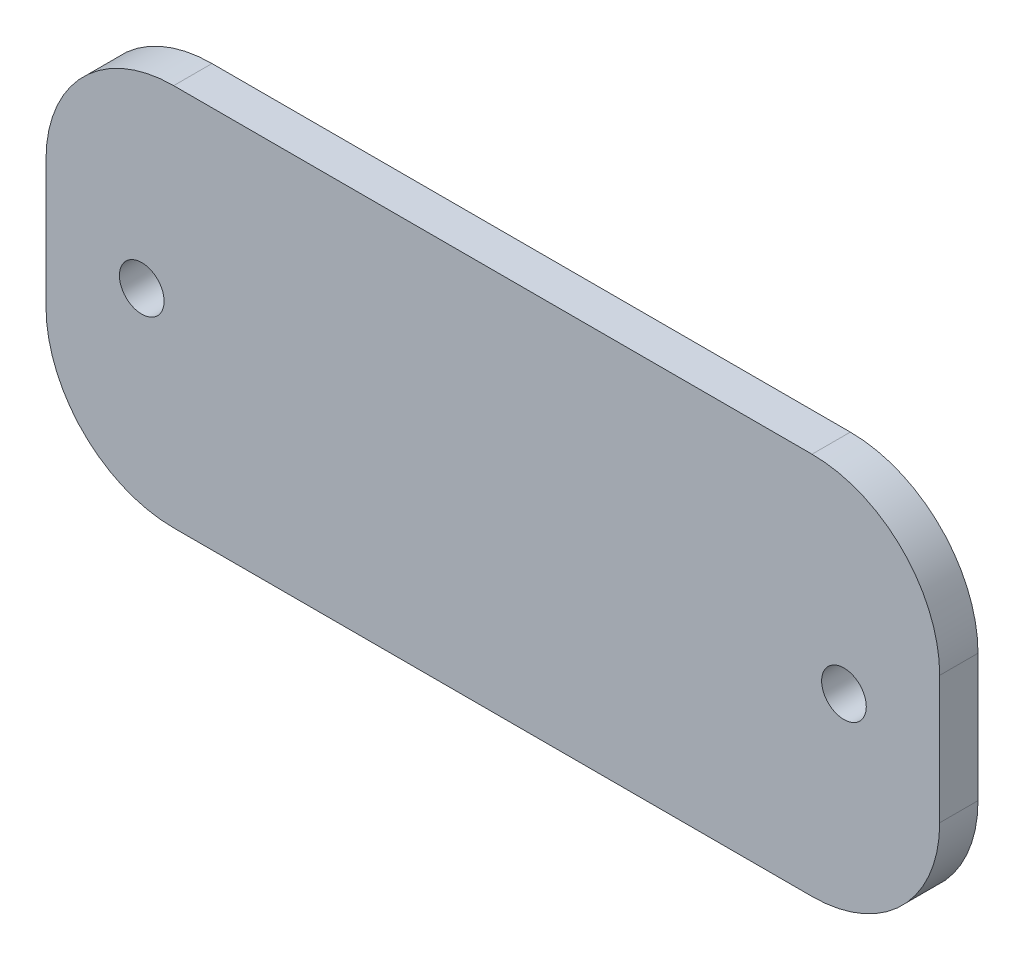
ISO-10303-21;
HEADER;
FILE_DESCRIPTION(('STEP AP214'),'2;1');
FILE_NAME('part.step','',(''),(''),'','','');
FILE_SCHEMA(('AUTOMOTIVE_DESIGN { 1 0 10303 214 1 1 1 1 }'));
ENDSEC;
DATA;
#1=APPLICATION_CONTEXT('core data for automotive mechanical design processes');
#2=APPLICATION_PROTOCOL_DEFINITION('international standard','automotive_design',2000,#1);
#3=PRODUCT_CONTEXT('',#1,'mechanical');
#4=PRODUCT('Part','Part','',(#3));
#5=PRODUCT_RELATED_PRODUCT_CATEGORY('part','',(#4));
#6=PRODUCT_DEFINITION_FORMATION('','',#4);
#7=PRODUCT_DEFINITION_CONTEXT('part definition',#1,'design');
#8=PRODUCT_DEFINITION('design','',#6,#7);
#9=PRODUCT_DEFINITION_SHAPE('','',#8);
#10=(LENGTH_UNIT() NAMED_UNIT(*) SI_UNIT(.MILLI.,.METRE.));
#11=(NAMED_UNIT(*) PLANE_ANGLE_UNIT() SI_UNIT($,.RADIAN.));
#12=(NAMED_UNIT(*) SI_UNIT($,.STERADIAN.) SOLID_ANGLE_UNIT());
#13=UNCERTAINTY_MEASURE_WITH_UNIT(LENGTH_MEASURE(1.E-05),#10,'distance_accuracy_value','');
#14=(GEOMETRIC_REPRESENTATION_CONTEXT(3) GLOBAL_UNCERTAINTY_ASSIGNED_CONTEXT((#13)) GLOBAL_UNIT_ASSIGNED_CONTEXT((#10,
#11,#12)) REPRESENTATION_CONTEXT('',''));
#15=CARTESIAN_POINT('',(0.,0.,0.));
#16=DIRECTION('',(0.,0.,1.));
#17=DIRECTION('',(1.,0.,0.));
#18=AXIS2_PLACEMENT_3D('',#15,#16,#17);
#19=CARTESIAN_POINT('',(25.,5.,3.));
#20=DIRECTION('',(0.,0.,-1.));
#21=DIRECTION('',(-1.,0.,0.));
#22=AXIS2_PLACEMENT_3D('',#19,#20,#21);
#23=CYLINDRICAL_SURFACE('',#22,10.);
#24=CARTESIAN_POINT('',(25.,5.,0.));
#25=DIRECTION('',(0.,0.,1.));
#26=DIRECTION('',(-1.,0.,0.));
#27=AXIS2_PLACEMENT_3D('',#24,#25,#26);
#28=CIRCLE('',#27,10.);
#29=CARTESIAN_POINT('',(35.,4.99999999999993,0.));
#30=VERTEX_POINT('',#29);
#31=CARTESIAN_POINT('',(24.9999999999999,15.,0.));
#32=VERTEX_POINT('',#31);
#33=EDGE_CURVE('E133',#30,#32,#28,.T.);
#34=ORIENTED_EDGE('',*,*,#33,.T.);
#35=DIRECTION('',(0.,0.,-1.));
#36=VECTOR('',#35,1.);
#37=CARTESIAN_POINT('',(24.9999999999999,15.,3.));
#38=LINE('',#37,#36);
#39=CARTESIAN_POINT('',(24.9999999999999,15.,3.));
#40=VERTEX_POINT('',#39);
#41=EDGE_CURVE('E11',#40,#32,#38,.T.);
#42=ORIENTED_EDGE('',*,*,#41,.F.);
#43=CARTESIAN_POINT('',(25.,5.,3.));
#44=DIRECTION('',(0.,0.,1.));
#45=DIRECTION('',(-1.,0.,0.));
#46=AXIS2_PLACEMENT_3D('',#43,#44,#45);
#47=CIRCLE('',#46,10.);
#48=CARTESIAN_POINT('',(35.,4.99999999999993,3.));
#49=VERTEX_POINT('',#48);
#50=EDGE_CURVE('E148',#49,#40,#47,.T.);
#51=ORIENTED_EDGE('',*,*,#50,.F.);
#52=DIRECTION('',(0.,0.,-1.));
#53=VECTOR('',#52,1.);
#54=CARTESIAN_POINT('',(35.,4.99999999999993,3.));
#55=LINE('',#54,#53);
#56=EDGE_CURVE('E129',#49,#30,#55,.T.);
#57=ORIENTED_EDGE('',*,*,#56,.T.);
#58=EDGE_LOOP('',(#34,#42,#51,#57));
#59=FACE_BOUND('',#58,.T.);
#60=ADVANCED_FACE('F37',(#59),#23,.T.);
#61=CARTESIAN_POINT('',(-24.9999999999999,15.,3.));
#62=DIRECTION('',(0.,-1.,0.));
#63=DIRECTION('',(0.,0.,-1.));
#64=AXIS2_PLACEMENT_3D('',#61,#62,#63);
#65=PLANE('',#64);
#66=DIRECTION('',(-1.,0.,0.));
#67=VECTOR('',#66,1.);
#68=CARTESIAN_POINT('',(-24.9999999999999,15.,0.));
#69=LINE('',#68,#67);
#70=CARTESIAN_POINT('',(-24.9999999999999,15.,0.));
#71=VERTEX_POINT('',#70);
#72=EDGE_CURVE('E136',#32,#71,#69,.T.);
#73=ORIENTED_EDGE('',*,*,#72,.T.);
#74=DIRECTION('',(0.,0.,-1.));
#75=VECTOR('',#74,1.);
#76=CARTESIAN_POINT('',(-24.9999999999999,15.,3.));
#77=LINE('',#76,#75);
#78=CARTESIAN_POINT('',(-24.9999999999999,15.,3.));
#79=VERTEX_POINT('',#78);
#80=EDGE_CURVE('E45',#79,#71,#77,.T.);
#81=ORIENTED_EDGE('',*,*,#80,.F.);
#82=DIRECTION('',(-1.,0.,0.));
#83=VECTOR('',#82,1.);
#84=CARTESIAN_POINT('',(-24.9999999999999,15.,3.));
#85=LINE('',#84,#83);
#86=EDGE_CURVE('E96',#40,#79,#85,.T.);
#87=ORIENTED_EDGE('',*,*,#86,.F.);
#88=ORIENTED_EDGE('',*,*,#41,.T.);
#89=EDGE_LOOP('',(#73,#81,#87,#88));
#90=FACE_BOUND('',#89,.T.);
#91=ADVANCED_FACE('F218',(#90),#65,.F.);
#92=CARTESIAN_POINT('',(-25.,5.00000000000001,3.));
#93=DIRECTION('',(0.,0.,-1.));
#94=DIRECTION('',(-1.,0.,0.));
#95=AXIS2_PLACEMENT_3D('',#92,#93,#94);
#96=CYLINDRICAL_SURFACE('',#95,9.99999999999999);
#97=CARTESIAN_POINT('',(-25.,5.00000000000001,0.));
#98=DIRECTION('',(0.,0.,1.));
#99=DIRECTION('',(1.,0.,0.));
#100=AXIS2_PLACEMENT_3D('',#97,#98,#99);
#101=CIRCLE('',#100,9.99999999999999);
#102=CARTESIAN_POINT('',(-35.,4.99999999999993,0.));
#103=VERTEX_POINT('',#102);
#104=EDGE_CURVE('E139',#71,#103,#101,.T.);
#105=ORIENTED_EDGE('',*,*,#104,.T.);
#106=DIRECTION('',(0.,0.,-1.));
#107=VECTOR('',#106,1.);
#108=CARTESIAN_POINT('',(-35.,4.99999999999993,3.));
#109=LINE('',#108,#107);
#110=CARTESIAN_POINT('',(-35.,4.99999999999993,3.));
#111=VERTEX_POINT('',#110);
#112=EDGE_CURVE('E155',#111,#103,#109,.T.);
#113=ORIENTED_EDGE('',*,*,#112,.F.);
#114=CARTESIAN_POINT('',(-25.,5.00000000000001,3.));
#115=DIRECTION('',(0.,0.,1.));
#116=DIRECTION('',(1.,0.,0.));
#117=AXIS2_PLACEMENT_3D('',#114,#115,#116);
#118=CIRCLE('',#117,9.99999999999999);
#119=EDGE_CURVE('E163',#79,#111,#118,.T.);
#120=ORIENTED_EDGE('',*,*,#119,.F.);
#121=ORIENTED_EDGE('',*,*,#80,.T.);
#122=EDGE_LOOP('',(#105,#113,#120,#121));
#123=FACE_BOUND('',#122,.T.);
#124=ADVANCED_FACE('F161',(#123),#96,.T.);
#125=CARTESIAN_POINT('',(-35.,4.99999999999993,3.));
#126=DIRECTION('',(1.,0.,0.));
#127=DIRECTION('',(0.,0.,-1.));
#128=AXIS2_PLACEMENT_3D('',#125,#126,#127);
#129=PLANE('',#128);
#130=DIRECTION('',(0.,-1.,0.));
#131=VECTOR('',#130,1.);
#132=CARTESIAN_POINT('',(-35.,4.99999999999993,0.));
#133=LINE('',#132,#131);
#134=CARTESIAN_POINT('',(-35.,-4.99999999999993,0.));
#135=VERTEX_POINT('',#134);
#136=EDGE_CURVE('E141',#103,#135,#133,.T.);
#137=ORIENTED_EDGE('',*,*,#136,.T.);
#138=DIRECTION('',(0.,0.,-1.));
#139=VECTOR('',#138,1.);
#140=CARTESIAN_POINT('',(-35.,-4.99999999999993,3.));
#141=LINE('',#140,#139);
#142=CARTESIAN_POINT('',(-35.,-4.99999999999993,3.));
#143=VERTEX_POINT('',#142);
#144=EDGE_CURVE('E152',#143,#135,#141,.T.);
#145=ORIENTED_EDGE('',*,*,#144,.F.);
#146=DIRECTION('',(0.,-1.,0.));
#147=VECTOR('',#146,1.);
#148=CARTESIAN_POINT('',(-35.,4.99999999999993,3.));
#149=LINE('',#148,#147);
#150=EDGE_CURVE('E175',#111,#143,#149,.T.);
#151=ORIENTED_EDGE('',*,*,#150,.F.);
#152=ORIENTED_EDGE('',*,*,#112,.T.);
#153=EDGE_LOOP('',(#137,#145,#151,#152));
#154=FACE_BOUND('',#153,.T.);
#155=ADVANCED_FACE('F171',(#154),#129,.F.);
#156=CARTESIAN_POINT('',(-25.,-5.,3.));
#157=DIRECTION('',(0.,0.,-1.));
#158=DIRECTION('',(-1.,0.,0.));
#159=AXIS2_PLACEMENT_3D('',#156,#157,#158);
#160=CYLINDRICAL_SURFACE('',#159,10.);
#161=CARTESIAN_POINT('',(-25.,-5.,0.));
#162=DIRECTION('',(0.,0.,1.));
#163=DIRECTION('',(1.,0.,0.));
#164=AXIS2_PLACEMENT_3D('',#161,#162,#163);
#165=CIRCLE('',#164,10.);
#166=CARTESIAN_POINT('',(-24.9999999999999,-15.,0.));
#167=VERTEX_POINT('',#166);
#168=EDGE_CURVE('E143',#135,#167,#165,.T.);
#169=ORIENTED_EDGE('',*,*,#168,.T.);
#170=DIRECTION('',(0.,0.,-1.));
#171=VECTOR('',#170,1.);
#172=CARTESIAN_POINT('',(-24.9999999999999,-15.,3.));
#173=LINE('',#172,#171);
#174=CARTESIAN_POINT('',(-24.9999999999999,-15.,3.));
#175=VERTEX_POINT('',#174);
#176=EDGE_CURVE('E124',#175,#167,#173,.T.);
#177=ORIENTED_EDGE('',*,*,#176,.F.);
#178=CARTESIAN_POINT('',(-25.,-5.,3.));
#179=DIRECTION('',(0.,0.,1.));
#180=DIRECTION('',(1.,0.,0.));
#181=AXIS2_PLACEMENT_3D('',#178,#179,#180);
#182=CIRCLE('',#181,10.);
#183=EDGE_CURVE('E115',#143,#175,#182,.T.);
#184=ORIENTED_EDGE('',*,*,#183,.F.);
#185=ORIENTED_EDGE('',*,*,#144,.T.);
#186=EDGE_LOOP('',(#169,#177,#184,#185));
#187=FACE_BOUND('',#186,.T.);
#188=ADVANCED_FACE('F174',(#187),#160,.T.);
#189=CARTESIAN_POINT('',(-24.9999999999999,-15.,3.));
#190=DIRECTION('',(0.,1.,0.));
#191=DIRECTION('',(0.,0.,1.));
#192=AXIS2_PLACEMENT_3D('',#189,#190,#191);
#193=PLANE('',#192);
#194=DIRECTION('',(1.,0.,0.));
#195=VECTOR('',#194,1.);
#196=CARTESIAN_POINT('',(-24.9999999999999,-15.,0.));
#197=LINE('',#196,#195);
#198=CARTESIAN_POINT('',(24.9999999999999,-15.,0.));
#199=VERTEX_POINT('',#198);
#200=EDGE_CURVE('E123',#167,#199,#197,.T.);
#201=ORIENTED_EDGE('',*,*,#200,.T.);
#202=DIRECTION('',(0.,0.,-1.));
#203=VECTOR('',#202,1.);
#204=CARTESIAN_POINT('',(24.9999999999999,-15.,3.));
#205=LINE('',#204,#203);
#206=CARTESIAN_POINT('',(24.9999999999999,-15.,3.));
#207=VERTEX_POINT('',#206);
#208=EDGE_CURVE('E120',#207,#199,#205,.T.);
#209=ORIENTED_EDGE('',*,*,#208,.F.);
#210=DIRECTION('',(1.,0.,0.));
#211=VECTOR('',#210,1.);
#212=CARTESIAN_POINT('',(-24.9999999999999,-15.,3.));
#213=LINE('',#212,#211);
#214=EDGE_CURVE('E109',#175,#207,#213,.T.);
#215=ORIENTED_EDGE('',*,*,#214,.F.);
#216=ORIENTED_EDGE('',*,*,#176,.T.);
#217=EDGE_LOOP('',(#201,#209,#215,#216));
#218=FACE_BOUND('',#217,.T.);
#219=ADVANCED_FACE('F121',(#218),#193,.F.);
#220=CARTESIAN_POINT('',(25.,-5.,3.));
#221=DIRECTION('',(0.,0.,-1.));
#222=DIRECTION('',(-1.,0.,0.));
#223=AXIS2_PLACEMENT_3D('',#220,#221,#222);
#224=CYLINDRICAL_SURFACE('',#223,9.99999999999999);
#225=CARTESIAN_POINT('',(25.,-5.,0.));
#226=DIRECTION('',(0.,0.,1.));
#227=DIRECTION('',(1.,0.,0.));
#228=AXIS2_PLACEMENT_3D('',#225,#226,#227);
#229=CIRCLE('',#228,9.99999999999999);
#230=CARTESIAN_POINT('',(35.,-5.,0.));
#231=VERTEX_POINT('',#230);
#232=EDGE_CURVE('E82',#199,#231,#229,.T.);
#233=ORIENTED_EDGE('',*,*,#232,.T.);
#234=DIRECTION('',(0.,0.,-1.));
#235=VECTOR('',#234,1.);
#236=CARTESIAN_POINT('',(35.,-5.,3.));
#237=LINE('',#236,#235);
#238=CARTESIAN_POINT('',(35.,-5.,3.));
#239=VERTEX_POINT('',#238);
#240=EDGE_CURVE('E125',#239,#231,#237,.T.);
#241=ORIENTED_EDGE('',*,*,#240,.F.);
#242=CARTESIAN_POINT('',(25.,-5.,3.));
#243=DIRECTION('',(0.,0.,1.));
#244=DIRECTION('',(1.,0.,0.));
#245=AXIS2_PLACEMENT_3D('',#242,#243,#244);
#246=CIRCLE('',#245,9.99999999999999);
#247=EDGE_CURVE('E113',#207,#239,#246,.T.);
#248=ORIENTED_EDGE('',*,*,#247,.F.);
#249=ORIENTED_EDGE('',*,*,#208,.T.);
#250=EDGE_LOOP('',(#233,#241,#248,#249));
#251=FACE_BOUND('',#250,.T.);
#252=ADVANCED_FACE('F127',(#251),#224,.T.);
#253=CARTESIAN_POINT('',(35.,4.99999999999993,3.));
#254=DIRECTION('',(-1.,0.,0.));
#255=DIRECTION('',(0.,0.,1.));
#256=AXIS2_PLACEMENT_3D('',#253,#254,#255);
#257=PLANE('',#256);
#258=DIRECTION('',(0.,1.,0.));
#259=VECTOR('',#258,1.);
#260=CARTESIAN_POINT('',(35.,4.99999999999993,0.));
#261=LINE('',#260,#259);
#262=EDGE_CURVE('E88',#231,#30,#261,.T.);
#263=ORIENTED_EDGE('',*,*,#262,.T.);
#264=ORIENTED_EDGE('',*,*,#56,.F.);
#265=DIRECTION('',(0.,1.,0.));
#266=VECTOR('',#265,1.);
#267=CARTESIAN_POINT('',(35.,4.99999999999993,3.));
#268=LINE('',#267,#266);
#269=EDGE_CURVE('E53',#239,#49,#268,.T.);
#270=ORIENTED_EDGE('',*,*,#269,.F.);
#271=ORIENTED_EDGE('',*,*,#240,.T.);
#272=EDGE_LOOP('',(#263,#264,#270,#271));
#273=FACE_BOUND('',#272,.T.);
#274=ADVANCED_FACE('F204',(#273),#257,.F.);
#275=CARTESIAN_POINT('',(25.,5.,3.));
#276=DIRECTION('',(0.,0.,-1.));
#277=DIRECTION('',(-1.,0.,0.));
#278=AXIS2_PLACEMENT_3D('',#275,#276,#277);
#279=PLANE('',#278);
#280=CARTESIAN_POINT('',(-27.5,0.,3.));
#281=DIRECTION('',(0.,0.,1.));
#282=DIRECTION('',(1.,0.,0.));
#283=AXIS2_PLACEMENT_3D('',#280,#281,#282);
#284=CIRCLE('',#283,1.75);
#285=CARTESIAN_POINT('',(-25.75,0.,3.));
#286=VERTEX_POINT('',#285);
#287=EDGE_CURVE('E187',#286,#286,#284,.T.);
#288=ORIENTED_EDGE('',*,*,#287,.F.);
#289=EDGE_LOOP('',(#288));
#290=FACE_BOUND('',#289,.T.);
#291=CARTESIAN_POINT('',(27.5,0.,3.));
#292=DIRECTION('',(0.,0.,1.));
#293=DIRECTION('',(1.,0.,0.));
#294=AXIS2_PLACEMENT_3D('',#291,#292,#293);
#295=CIRCLE('',#294,1.75);
#296=CARTESIAN_POINT('',(29.25,0.,3.));
#297=VERTEX_POINT('',#296);
#298=EDGE_CURVE('E184',#297,#297,#295,.T.);
#299=ORIENTED_EDGE('',*,*,#298,.F.);
#300=EDGE_LOOP('',(#299));
#301=FACE_BOUND('',#300,.T.);
#302=ORIENTED_EDGE('',*,*,#50,.T.);
#303=ORIENTED_EDGE('',*,*,#86,.T.);
#304=ORIENTED_EDGE('',*,*,#119,.T.);
#305=ORIENTED_EDGE('',*,*,#150,.T.);
#306=ORIENTED_EDGE('',*,*,#183,.T.);
#307=ORIENTED_EDGE('',*,*,#214,.T.);
#308=ORIENTED_EDGE('',*,*,#247,.T.);
#309=ORIENTED_EDGE('',*,*,#269,.T.);
#310=EDGE_LOOP('',(#302,#303,#304,#305,#306,#307,#308,#309));
#311=FACE_BOUND('',#310,.T.);
#312=ADVANCED_FACE('F111',(#290,#301,#311),#279,.F.);
#313=CARTESIAN_POINT('',(25.,5.,0.));
#314=DIRECTION('',(0.,0.,-1.));
#315=DIRECTION('',(-1.,0.,0.));
#316=AXIS2_PLACEMENT_3D('',#313,#314,#315);
#317=PLANE('',#316);
#318=CARTESIAN_POINT('',(-27.5,0.,0.));
#319=DIRECTION('',(0.,0.,1.));
#320=DIRECTION('',(1.,0.,0.));
#321=AXIS2_PLACEMENT_3D('',#318,#319,#320);
#322=CIRCLE('',#321,1.75);
#323=CARTESIAN_POINT('',(-25.75,0.,0.));
#324=VERTEX_POINT('',#323);
#325=EDGE_CURVE('E137',#324,#324,#322,.T.);
#326=ORIENTED_EDGE('',*,*,#325,.T.);
#327=EDGE_LOOP('',(#326));
#328=FACE_BOUND('',#327,.T.);
#329=CARTESIAN_POINT('',(27.5,0.,0.));
#330=DIRECTION('',(0.,0.,1.));
#331=DIRECTION('',(1.,0.,0.));
#332=AXIS2_PLACEMENT_3D('',#329,#330,#331);
#333=CIRCLE('',#332,1.75);
#334=CARTESIAN_POINT('',(29.25,0.,0.));
#335=VERTEX_POINT('',#334);
#336=EDGE_CURVE('E181',#335,#335,#333,.T.);
#337=ORIENTED_EDGE('',*,*,#336,.T.);
#338=EDGE_LOOP('',(#337));
#339=FACE_BOUND('',#338,.T.);
#340=ORIENTED_EDGE('',*,*,#33,.F.);
#341=ORIENTED_EDGE('',*,*,#262,.F.);
#342=ORIENTED_EDGE('',*,*,#232,.F.);
#343=ORIENTED_EDGE('',*,*,#200,.F.);
#344=ORIENTED_EDGE('',*,*,#168,.F.);
#345=ORIENTED_EDGE('',*,*,#136,.F.);
#346=ORIENTED_EDGE('',*,*,#104,.F.);
#347=ORIENTED_EDGE('',*,*,#72,.F.);
#348=EDGE_LOOP('',(#340,#341,#342,#343,#344,#345,#346,#347));
#349=FACE_BOUND('',#348,.T.);
#350=ADVANCED_FACE('F167',(#328,#339,#349),#317,.T.);
#351=CARTESIAN_POINT('',(27.5,0.,0.));
#352=DIRECTION('',(0.,0.,1.));
#353=DIRECTION('',(1.,0.,0.));
#354=AXIS2_PLACEMENT_3D('',#351,#352,#353);
#355=CYLINDRICAL_SURFACE('',#354,1.75);
#356=ORIENTED_EDGE('',*,*,#336,.F.);
#357=EDGE_LOOP('',(#356));
#358=FACE_BOUND('',#357,.T.);
#359=ORIENTED_EDGE('',*,*,#298,.T.);
#360=EDGE_LOOP('',(#359));
#361=FACE_BOUND('',#360,.T.);
#362=ADVANCED_FACE('F198',(#358,#361),#355,.F.);
#363=CARTESIAN_POINT('',(-27.5,0.,0.));
#364=DIRECTION('',(0.,0.,1.));
#365=DIRECTION('',(1.,0.,0.));
#366=AXIS2_PLACEMENT_3D('',#363,#364,#365);
#367=CYLINDRICAL_SURFACE('',#366,1.75);
#368=ORIENTED_EDGE('',*,*,#325,.F.);
#369=EDGE_LOOP('',(#368));
#370=FACE_BOUND('',#369,.T.);
#371=ORIENTED_EDGE('',*,*,#287,.T.);
#372=EDGE_LOOP('',(#371));
#373=FACE_BOUND('',#372,.T.);
#374=ADVANCED_FACE('F195',(#370,#373),#367,.F.);
#375=CLOSED_SHELL('',(#60,#91,#124,#155,#188,#219,#252,#274,#312,#350,#362,#374));
#376=MANIFOLD_SOLID_BREP('B2',#375);
#377=ADVANCED_BREP_SHAPE_REPRESENTATION('',(#18,#376),#14);
#378=SHAPE_DEFINITION_REPRESENTATION(#9,#377);
ENDSEC;
END-ISO-10303-21;
